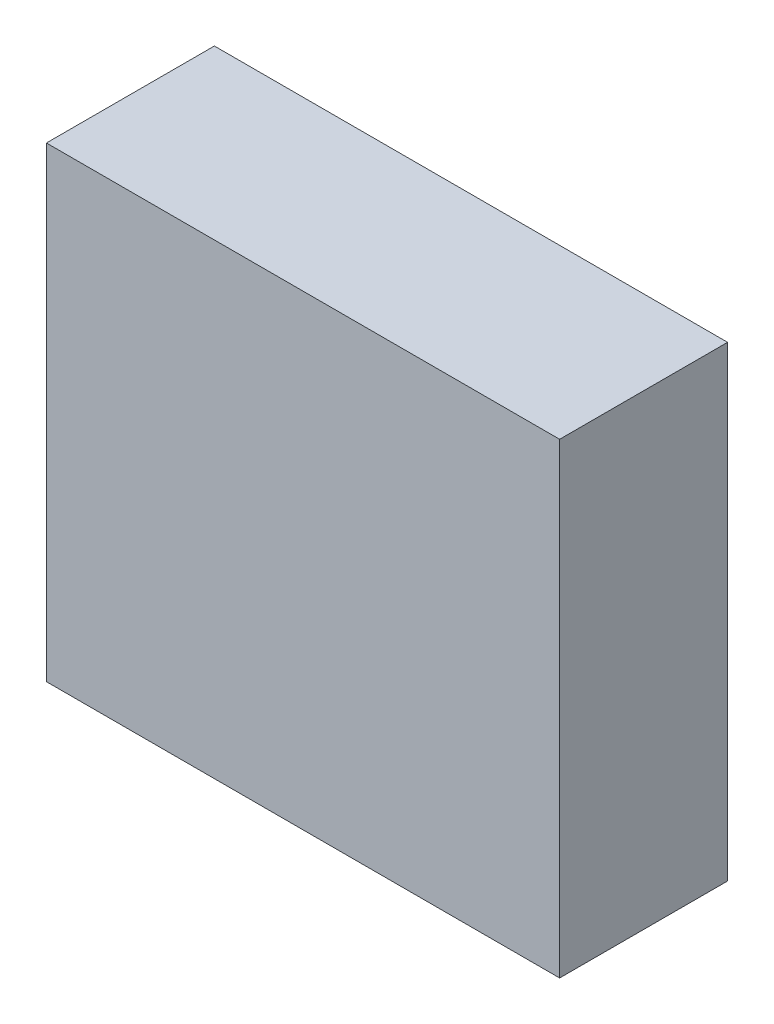
ISO-10303-21;
HEADER;
FILE_DESCRIPTION(('STEP AP214'),'2;1');
FILE_NAME('part.step','',(''),(''),'','','');
FILE_SCHEMA(('AUTOMOTIVE_DESIGN { 1 0 10303 214 1 1 1 1 }'));
ENDSEC;
DATA;
#1=APPLICATION_CONTEXT('core data for automotive mechanical design processes');
#2=APPLICATION_PROTOCOL_DEFINITION('international standard','automotive_design',2000,#1);
#3=PRODUCT_CONTEXT('',#1,'mechanical');
#4=PRODUCT('Part','Part','',(#3));
#5=PRODUCT_RELATED_PRODUCT_CATEGORY('part','',(#4));
#6=PRODUCT_DEFINITION_FORMATION('','',#4);
#7=PRODUCT_DEFINITION_CONTEXT('part definition',#1,'design');
#8=PRODUCT_DEFINITION('design','',#6,#7);
#9=PRODUCT_DEFINITION_SHAPE('','',#8);
#10=(LENGTH_UNIT() NAMED_UNIT(*) SI_UNIT(.MILLI.,.METRE.));
#11=(NAMED_UNIT(*) PLANE_ANGLE_UNIT() SI_UNIT($,.RADIAN.));
#12=(NAMED_UNIT(*) SI_UNIT($,.STERADIAN.) SOLID_ANGLE_UNIT());
#13=UNCERTAINTY_MEASURE_WITH_UNIT(LENGTH_MEASURE(1.E-05),#10,'distance_accuracy_value','');
#14=(GEOMETRIC_REPRESENTATION_CONTEXT(3) GLOBAL_UNCERTAINTY_ASSIGNED_CONTEXT((#13)) GLOBAL_UNIT_ASSIGNED_CONTEXT((#10,
#11,#12)) REPRESENTATION_CONTEXT('',''));
#15=CARTESIAN_POINT('',(0.,0.,0.));
#16=DIRECTION('',(0.,0.,1.));
#17=DIRECTION('',(1.,0.,0.));
#18=AXIS2_PLACEMENT_3D('',#15,#16,#17);
#19=CARTESIAN_POINT('',(-1.37499852,-1.25000004,0.90000074));
#20=DIRECTION('',(0.,0.,1.));
#21=DIRECTION('',(1.,0.,0.));
#22=AXIS2_PLACEMENT_3D('',#19,#20,#21);
#23=PLANE('',#22);
#24=DIRECTION('',(0.,1.,0.));
#25=VECTOR('',#24,1.);
#26=CARTESIAN_POINT('',(-1.37499852,-1.25000004,0.90000074));
#27=LINE('',#26,#25);
#28=CARTESIAN_POINT('',(-1.37499852,-1.25000004,0.90000074));
#29=VERTEX_POINT('',#28);
#30=CARTESIAN_POINT('',(-1.37499852,1.25000004,0.90000074));
#31=VERTEX_POINT('',#30);
#32=EDGE_CURVE('E100',#29,#31,#27,.T.);
#33=ORIENTED_EDGE('',*,*,#32,.F.);
#34=DIRECTION('',(-1.,0.,0.));
#35=VECTOR('',#34,1.);
#36=CARTESIAN_POINT('',(1.37500106,-1.25000004,0.90000074));
#37=LINE('',#36,#35);
#38=CARTESIAN_POINT('',(1.37500106,-1.25000004,0.90000074));
#39=VERTEX_POINT('',#38);
#40=EDGE_CURVE('E28',#39,#29,#37,.T.);
#41=ORIENTED_EDGE('',*,*,#40,.F.);
#42=DIRECTION('',(0.,-1.,0.));
#43=VECTOR('',#42,1.);
#44=CARTESIAN_POINT('',(1.37500106,1.25000004,0.90000074));
#45=LINE('',#44,#43);
#46=CARTESIAN_POINT('',(1.37500106,1.25000004,0.90000074));
#47=VERTEX_POINT('',#46);
#48=EDGE_CURVE('E72',#47,#39,#45,.T.);
#49=ORIENTED_EDGE('',*,*,#48,.F.);
#50=DIRECTION('',(1.,0.,0.));
#51=VECTOR('',#50,1.);
#52=CARTESIAN_POINT('',(-1.37499852,1.25000004,0.90000074));
#53=LINE('',#52,#51);
#54=EDGE_CURVE('E75',#31,#47,#53,.T.);
#55=ORIENTED_EDGE('',*,*,#54,.F.);
#56=EDGE_LOOP('',(#33,#41,#49,#55));
#57=FACE_BOUND('',#56,.T.);
#58=ADVANCED_FACE('F17',(#57),#23,.T.);
#59=CARTESIAN_POINT('',(-1.37499852,-1.25000004,0.));
#60=DIRECTION('',(0.,0.,1.));
#61=DIRECTION('',(1.,0.,0.));
#62=AXIS2_PLACEMENT_3D('',#59,#60,#61);
#63=PLANE('',#62);
#64=DIRECTION('',(0.,1.,0.));
#65=VECTOR('',#64,1.);
#66=CARTESIAN_POINT('',(-1.37499852,-1.25000004,0.));
#67=LINE('',#66,#65);
#68=CARTESIAN_POINT('',(-1.37499852,-1.25000004,0.));
#69=VERTEX_POINT('',#68);
#70=CARTESIAN_POINT('',(-1.37499852,1.25000004,0.));
#71=VERTEX_POINT('',#70);
#72=EDGE_CURVE('E90',#69,#71,#67,.T.);
#73=ORIENTED_EDGE('',*,*,#72,.T.);
#74=DIRECTION('',(1.,0.,0.));
#75=VECTOR('',#74,1.);
#76=CARTESIAN_POINT('',(-1.37499852,1.25000004,0.));
#77=LINE('',#76,#75);
#78=CARTESIAN_POINT('',(1.37500106,1.25000004,0.));
#79=VERTEX_POINT('',#78);
#80=EDGE_CURVE('E80',#71,#79,#77,.T.);
#81=ORIENTED_EDGE('',*,*,#80,.T.);
#82=DIRECTION('',(0.,-1.,0.));
#83=VECTOR('',#82,1.);
#84=CARTESIAN_POINT('',(1.37500106,1.25000004,0.));
#85=LINE('',#84,#83);
#86=CARTESIAN_POINT('',(1.37500106,-1.25000004,0.));
#87=VERTEX_POINT('',#86);
#88=EDGE_CURVE('E65',#79,#87,#85,.T.);
#89=ORIENTED_EDGE('',*,*,#88,.T.);
#90=DIRECTION('',(-1.,0.,0.));
#91=VECTOR('',#90,1.);
#92=CARTESIAN_POINT('',(1.37500106,-1.25000004,0.));
#93=LINE('',#92,#91);
#94=EDGE_CURVE('E11',#87,#69,#93,.T.);
#95=ORIENTED_EDGE('',*,*,#94,.T.);
#96=EDGE_LOOP('',(#73,#81,#89,#95));
#97=FACE_BOUND('',#96,.T.);
#98=ADVANCED_FACE('F157',(#97),#63,.F.);
#99=CARTESIAN_POINT('',(1.37500106,-1.25000004,0.));
#100=DIRECTION('',(0.,-1.,0.));
#101=DIRECTION('',(0.,0.,-1.));
#102=AXIS2_PLACEMENT_3D('',#99,#100,#101);
#103=PLANE('',#102);
#104=DIRECTION('',(0.,0.,1.));
#105=VECTOR('',#104,1.);
#106=CARTESIAN_POINT('',(1.37500106,-1.25000004,0.));
#107=LINE('',#106,#105);
#108=EDGE_CURVE('E79',#87,#39,#107,.T.);
#109=ORIENTED_EDGE('',*,*,#108,.T.);
#110=ORIENTED_EDGE('',*,*,#40,.T.);
#111=DIRECTION('',(0.,0.,1.));
#112=VECTOR('',#111,1.);
#113=CARTESIAN_POINT('',(-1.37499852,-1.25000004,0.));
#114=LINE('',#113,#112);
#115=EDGE_CURVE('E102',#69,#29,#114,.T.);
#116=ORIENTED_EDGE('',*,*,#115,.F.);
#117=ORIENTED_EDGE('',*,*,#94,.F.);
#118=EDGE_LOOP('',(#109,#110,#116,#117));
#119=FACE_BOUND('',#118,.T.);
#120=ADVANCED_FACE('F121',(#119),#103,.T.);
#121=CARTESIAN_POINT('',(1.37500106,1.25000004,0.));
#122=DIRECTION('',(1.,0.,0.));
#123=DIRECTION('',(0.,1.,0.));
#124=AXIS2_PLACEMENT_3D('',#121,#122,#123);
#125=PLANE('',#124);
#126=DIRECTION('',(0.,0.,1.));
#127=VECTOR('',#126,1.);
#128=CARTESIAN_POINT('',(1.37500106,1.25000004,0.));
#129=LINE('',#128,#127);
#130=EDGE_CURVE('E21',#79,#47,#129,.T.);
#131=ORIENTED_EDGE('',*,*,#130,.T.);
#132=ORIENTED_EDGE('',*,*,#48,.T.);
#133=ORIENTED_EDGE('',*,*,#108,.F.);
#134=ORIENTED_EDGE('',*,*,#88,.F.);
#135=EDGE_LOOP('',(#131,#132,#133,#134));
#136=FACE_BOUND('',#135,.T.);
#137=ADVANCED_FACE('F83',(#136),#125,.T.);
#138=CARTESIAN_POINT('',(-1.37499852,1.25000004,0.));
#139=DIRECTION('',(0.,1.,0.));
#140=DIRECTION('',(1.,0.,0.));
#141=AXIS2_PLACEMENT_3D('',#138,#139,#140);
#142=PLANE('',#141);
#143=DIRECTION('',(0.,0.,1.));
#144=VECTOR('',#143,1.);
#145=CARTESIAN_POINT('',(-1.37499852,1.25000004,0.));
#146=LINE('',#145,#144);
#147=EDGE_CURVE('E87',#71,#31,#146,.T.);
#148=ORIENTED_EDGE('',*,*,#147,.T.);
#149=ORIENTED_EDGE('',*,*,#54,.T.);
#150=ORIENTED_EDGE('',*,*,#130,.F.);
#151=ORIENTED_EDGE('',*,*,#80,.F.);
#152=EDGE_LOOP('',(#148,#149,#150,#151));
#153=FACE_BOUND('',#152,.T.);
#154=ADVANCED_FACE('F19',(#153),#142,.T.);
#155=CARTESIAN_POINT('',(-1.37499852,-1.25000004,0.));
#156=DIRECTION('',(-1.,0.,0.));
#157=DIRECTION('',(0.,0.,1.));
#158=AXIS2_PLACEMENT_3D('',#155,#156,#157);
#159=PLANE('',#158);
#160=ORIENTED_EDGE('',*,*,#115,.T.);
#161=ORIENTED_EDGE('',*,*,#32,.T.);
#162=ORIENTED_EDGE('',*,*,#147,.F.);
#163=ORIENTED_EDGE('',*,*,#72,.F.);
#164=EDGE_LOOP('',(#160,#161,#162,#163));
#165=FACE_BOUND('',#164,.T.);
#166=ADVANCED_FACE('F118',(#165),#159,.T.);
#167=CLOSED_SHELL('',(#58,#98,#120,#137,#154,#166));
#168=MANIFOLD_SOLID_BREP('B1',#167);
#169=ADVANCED_BREP_SHAPE_REPRESENTATION('',(#18,#168),#14);
#170=SHAPE_DEFINITION_REPRESENTATION(#9,#169);
ENDSEC;
END-ISO-10303-21;
